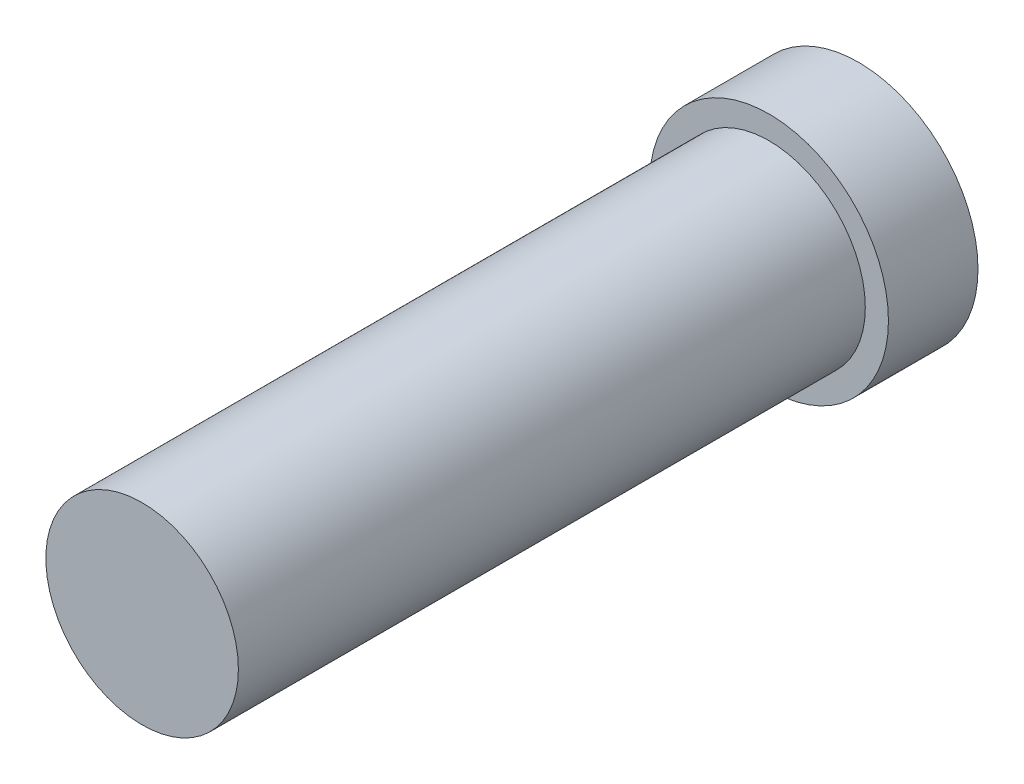
ISO-10303-21;
HEADER;
FILE_DESCRIPTION(('STEP AP214'),'2;1');
FILE_NAME('part.step','',(''),(''),'','','');
FILE_SCHEMA(('AUTOMOTIVE_DESIGN { 1 0 10303 214 1 1 1 1 }'));
ENDSEC;
DATA;
#1=APPLICATION_CONTEXT('core data for automotive mechanical design processes');
#2=APPLICATION_PROTOCOL_DEFINITION('international standard','automotive_design',2000,#1);
#3=PRODUCT_CONTEXT('',#1,'mechanical');
#4=PRODUCT('Part','Part','',(#3));
#5=PRODUCT_RELATED_PRODUCT_CATEGORY('part','',(#4));
#6=PRODUCT_DEFINITION_FORMATION('','',#4);
#7=PRODUCT_DEFINITION_CONTEXT('part definition',#1,'design');
#8=PRODUCT_DEFINITION('design','',#6,#7);
#9=PRODUCT_DEFINITION_SHAPE('','',#8);
#10=(LENGTH_UNIT() NAMED_UNIT(*) SI_UNIT(.MILLI.,.METRE.));
#11=(NAMED_UNIT(*) PLANE_ANGLE_UNIT() SI_UNIT($,.RADIAN.));
#12=(NAMED_UNIT(*) SI_UNIT($,.STERADIAN.) SOLID_ANGLE_UNIT());
#13=UNCERTAINTY_MEASURE_WITH_UNIT(LENGTH_MEASURE(1.E-05),#10,'distance_accuracy_value','');
#14=(GEOMETRIC_REPRESENTATION_CONTEXT(3) GLOBAL_UNCERTAINTY_ASSIGNED_CONTEXT((#13)) GLOBAL_UNIT_ASSIGNED_CONTEXT((#10,
#11,#12)) REPRESENTATION_CONTEXT('',''));
#15=CARTESIAN_POINT('',(0.,0.,0.));
#16=DIRECTION('',(0.,0.,1.));
#17=DIRECTION('',(1.,0.,0.));
#18=AXIS2_PLACEMENT_3D('',#15,#16,#17);
#19=CARTESIAN_POINT('',(0.,0.,21.));
#20=DIRECTION('',(0.,0.,-1.));
#21=DIRECTION('',(-1.,0.,0.));
#22=AXIS2_PLACEMENT_3D('',#19,#20,#21);
#23=CYLINDRICAL_SURFACE('',#22,3.225);
#24=CARTESIAN_POINT('',(0.,0.,21.));
#25=DIRECTION('',(0.,0.,1.));
#26=DIRECTION('',(1.,0.,0.));
#27=AXIS2_PLACEMENT_3D('',#24,#25,#26);
#28=CIRCLE('',#27,3.225);
#29=CARTESIAN_POINT('',(3.225,0.,21.));
#30=VERTEX_POINT('',#29);
#31=EDGE_CURVE('E10',#30,#30,#28,.T.);
#32=ORIENTED_EDGE('',*,*,#31,.F.);
#33=EDGE_LOOP('',(#32));
#34=FACE_BOUND('',#33,.T.);
#35=CARTESIAN_POINT('',(0.,0.,0.));
#36=DIRECTION('',(0.,0.,1.));
#37=DIRECTION('',(1.,0.,0.));
#38=AXIS2_PLACEMENT_3D('',#35,#36,#37);
#39=CIRCLE('',#38,3.225);
#40=CARTESIAN_POINT('',(3.225,0.,0.));
#41=VERTEX_POINT('',#40);
#42=EDGE_CURVE('E46',#41,#41,#39,.T.);
#43=ORIENTED_EDGE('',*,*,#42,.T.);
#44=EDGE_LOOP('',(#43));
#45=FACE_BOUND('',#44,.T.);
#46=ADVANCED_FACE('F43',(#34,#45),#23,.T.);
#47=CARTESIAN_POINT('',(0.,0.,21.));
#48=DIRECTION('',(0.,0.,1.));
#49=DIRECTION('',(1.,0.,0.));
#50=AXIS2_PLACEMENT_3D('',#47,#48,#49);
#51=PLANE('',#50);
#52=ORIENTED_EDGE('',*,*,#31,.T.);
#53=EDGE_LOOP('',(#52));
#54=FACE_BOUND('',#53,.T.);
#55=ADVANCED_FACE('F78',(#54),#51,.T.);
#56=CARTESIAN_POINT('',(0.,0.,-3.));
#57=DIRECTION('',(0.,0.,1.));
#58=DIRECTION('',(1.,0.,0.));
#59=AXIS2_PLACEMENT_3D('',#56,#57,#58);
#60=CYLINDRICAL_SURFACE('',#59,4.);
#61=CARTESIAN_POINT('',(0.,0.,-3.));
#62=DIRECTION('',(0.,0.,1.));
#63=DIRECTION('',(1.,0.,0.));
#64=AXIS2_PLACEMENT_3D('',#61,#62,#63);
#65=CIRCLE('',#64,4.);
#66=CARTESIAN_POINT('',(4.,0.,-3.));
#67=VERTEX_POINT('',#66);
#68=EDGE_CURVE('E55',#67,#67,#65,.T.);
#69=ORIENTED_EDGE('',*,*,#68,.T.);
#70=EDGE_LOOP('',(#69));
#71=FACE_BOUND('',#70,.T.);
#72=CARTESIAN_POINT('',(0.,0.,0.));
#73=DIRECTION('',(0.,0.,1.));
#74=DIRECTION('',(1.,0.,0.));
#75=AXIS2_PLACEMENT_3D('',#72,#73,#74);
#76=CIRCLE('',#75,4.);
#77=CARTESIAN_POINT('',(4.,0.,0.));
#78=VERTEX_POINT('',#77);
#79=EDGE_CURVE('E57',#78,#78,#76,.T.);
#80=ORIENTED_EDGE('',*,*,#79,.F.);
#81=EDGE_LOOP('',(#80));
#82=FACE_BOUND('',#81,.T.);
#83=ADVANCED_FACE('F65',(#71,#82),#60,.T.);
#84=CARTESIAN_POINT('',(0.,0.,-3.));
#85=DIRECTION('',(0.,0.,1.));
#86=DIRECTION('',(1.,0.,0.));
#87=AXIS2_PLACEMENT_3D('',#84,#85,#86);
#88=PLANE('',#87);
#89=ORIENTED_EDGE('',*,*,#68,.F.);
#90=EDGE_LOOP('',(#89));
#91=FACE_BOUND('',#90,.T.);
#92=ADVANCED_FACE('F68',(#91),#88,.F.);
#93=CARTESIAN_POINT('',(0.,0.,0.));
#94=DIRECTION('',(0.,0.,1.));
#95=DIRECTION('',(1.,0.,0.));
#96=AXIS2_PLACEMENT_3D('',#93,#94,#95);
#97=PLANE('',#96);
#98=ORIENTED_EDGE('',*,*,#42,.F.);
#99=EDGE_LOOP('',(#98));
#100=FACE_BOUND('',#99,.T.);
#101=ORIENTED_EDGE('',*,*,#79,.T.);
#102=EDGE_LOOP('',(#101));
#103=FACE_BOUND('',#102,.T.);
#104=ADVANCED_FACE('F70',(#100,#103),#97,.T.);
#105=CLOSED_SHELL('',(#46,#55,#83,#92,#104));
#106=MANIFOLD_SOLID_BREP('B2',#105);
#107=ADVANCED_BREP_SHAPE_REPRESENTATION('',(#18,#106),#14);
#108=SHAPE_DEFINITION_REPRESENTATION(#9,#107);
ENDSEC;
END-ISO-10303-21;
